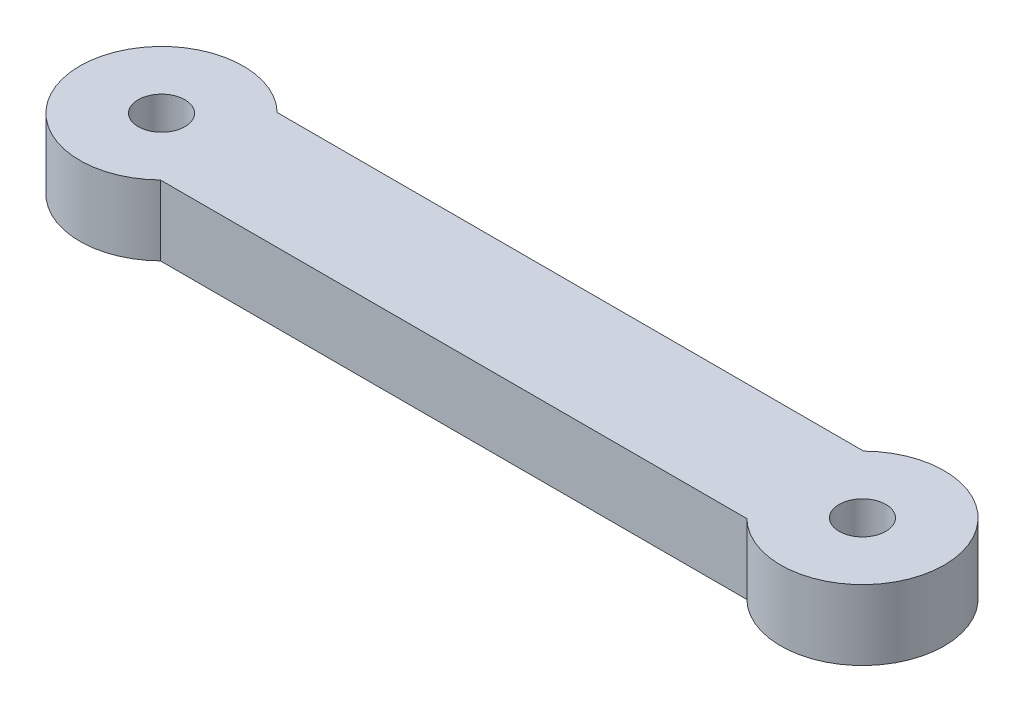
ISO-10303-21;
HEADER;
FILE_DESCRIPTION(('STEP AP214'),'2;1');
FILE_NAME('part.step','',(''),(''),'','','');
FILE_SCHEMA(('AUTOMOTIVE_DESIGN { 1 0 10303 214 1 1 1 1 }'));
ENDSEC;
DATA;
#1=APPLICATION_CONTEXT('core data for automotive mechanical design processes');
#2=APPLICATION_PROTOCOL_DEFINITION('international standard','automotive_design',2000,#1);
#3=PRODUCT_CONTEXT('',#1,'mechanical');
#4=PRODUCT('Part','Part','',(#3));
#5=PRODUCT_RELATED_PRODUCT_CATEGORY('part','',(#4));
#6=PRODUCT_DEFINITION_FORMATION('','',#4);
#7=PRODUCT_DEFINITION_CONTEXT('part definition',#1,'design');
#8=PRODUCT_DEFINITION('design','',#6,#7);
#9=PRODUCT_DEFINITION_SHAPE('','',#8);
#10=(LENGTH_UNIT() NAMED_UNIT(*) SI_UNIT(.MILLI.,.METRE.));
#11=(NAMED_UNIT(*) PLANE_ANGLE_UNIT() SI_UNIT($,.RADIAN.));
#12=(NAMED_UNIT(*) SI_UNIT($,.STERADIAN.) SOLID_ANGLE_UNIT());
#13=UNCERTAINTY_MEASURE_WITH_UNIT(LENGTH_MEASURE(1.E-05),#10,'distance_accuracy_value','');
#14=(GEOMETRIC_REPRESENTATION_CONTEXT(3) GLOBAL_UNCERTAINTY_ASSIGNED_CONTEXT((#13)) GLOBAL_UNIT_ASSIGNED_CONTEXT((#10,
#11,#12)) REPRESENTATION_CONTEXT('',''));
#15=CARTESIAN_POINT('',(0.,0.,0.));
#16=DIRECTION('',(0.,0.,1.));
#17=DIRECTION('',(1.,0.,0.));
#18=AXIS2_PLACEMENT_3D('',#15,#16,#17);
#19=CARTESIAN_POINT('',(-15.8097455641115,3.,1.20185155481779));
#20=DIRECTION('',(0.,1.,0.));
#21=DIRECTION('',(0.,0.,1.));
#22=AXIS2_PLACEMENT_3D('',#19,#20,#21);
#23=PLANE('',#22);
#24=CARTESIAN_POINT('',(-15.8097455641115,3.,1.20185155481779));
#25=DIRECTION('',(0.,1.,0.));
#26=DIRECTION('',(0.,0.,1.));
#27=AXIS2_PLACEMENT_3D('',#24,#25,#26);
#28=CIRCLE('',#27,1.);
#29=CARTESIAN_POINT('',(-15.8097455641115,3.,2.20185155481779));
#30=VERTEX_POINT('',#29);
#31=EDGE_CURVE('E100',#30,#30,#28,.T.);
#32=ORIENTED_EDGE('',*,*,#31,.F.);
#33=EDGE_LOOP('',(#32));
#34=FACE_BOUND('',#33,.T.);
#35=CARTESIAN_POINT('',(-15.8097455641115,3.,1.20185155481779));
#36=DIRECTION('',(0.,1.,0.));
#37=DIRECTION('',(0.,0.,1.));
#38=AXIS2_PLACEMENT_3D('',#35,#36,#37);
#39=CIRCLE('',#38,3.5);
#40=CARTESIAN_POINT('',(-13.3602558213283,3.,-1.29814844518222));
#41=VERTEX_POINT('',#40);
#42=CARTESIAN_POINT('',(-13.3602558213283,3.,3.70185155481778));
#43=VERTEX_POINT('',#42);
#44=EDGE_CURVE('E85',#41,#43,#39,.T.);
#45=ORIENTED_EDGE('',*,*,#44,.T.);
#46=DIRECTION('',(1.,0.,0.));
#47=VECTOR('',#46,1.);
#48=CARTESIAN_POINT('',(-13.3602558213283,3.,3.70185155481778));
#49=LINE('',#48,#47);
#50=CARTESIAN_POINT('',(11.7407646931053,3.,3.70185155481778));
#51=VERTEX_POINT('',#50);
#52=EDGE_CURVE('E80',#43,#51,#49,.T.);
#53=ORIENTED_EDGE('',*,*,#52,.T.);
#54=CARTESIAN_POINT('',(14.1902544358885,3.,1.20185155481778));
#55=DIRECTION('',(0.,1.,0.));
#56=DIRECTION('',(0.,0.,1.));
#57=AXIS2_PLACEMENT_3D('',#54,#55,#56);
#58=CIRCLE('',#57,3.5);
#59=CARTESIAN_POINT('',(11.7407646931053,3.,-1.29814844518222));
#60=VERTEX_POINT('',#59);
#61=EDGE_CURVE('E83',#51,#60,#58,.T.);
#62=ORIENTED_EDGE('',*,*,#61,.T.);
#63=DIRECTION('',(-1.,0.,0.));
#64=VECTOR('',#63,1.);
#65=CARTESIAN_POINT('',(-13.3602558213283,3.,-1.29814844518222));
#66=LINE('',#65,#64);
#67=EDGE_CURVE('E50',#60,#41,#66,.T.);
#68=ORIENTED_EDGE('',*,*,#67,.T.);
#69=EDGE_LOOP('',(#45,#53,#62,#68));
#70=FACE_BOUND('',#69,.T.);
#71=CARTESIAN_POINT('',(14.1902544358885,3.,1.20185155481778));
#72=DIRECTION('',(0.,1.,0.));
#73=DIRECTION('',(0.,0.,1.));
#74=AXIS2_PLACEMENT_3D('',#71,#72,#73);
#75=CIRCLE('',#74,1.);
#76=CARTESIAN_POINT('',(14.1902544358885,3.,2.20185155481778));
#77=VERTEX_POINT('',#76);
#78=EDGE_CURVE('E115',#77,#77,#75,.T.);
#79=ORIENTED_EDGE('',*,*,#78,.F.);
#80=EDGE_LOOP('',(#79));
#81=FACE_BOUND('',#80,.T.);
#82=ADVANCED_FACE('F33',(#34,#70,#81),#23,.T.);
#83=CARTESIAN_POINT('',(-15.8097455641115,0.,1.20185155481779));
#84=DIRECTION('',(0.,1.,0.));
#85=DIRECTION('',(0.,0.,1.));
#86=AXIS2_PLACEMENT_3D('',#83,#84,#85);
#87=PLANE('',#86);
#88=CARTESIAN_POINT('',(-15.8097455641115,0.,1.20185155481779));
#89=DIRECTION('',(0.,1.,0.));
#90=DIRECTION('',(0.,0.,1.));
#91=AXIS2_PLACEMENT_3D('',#88,#89,#90);
#92=CIRCLE('',#91,1.);
#93=CARTESIAN_POINT('',(-15.8097455641115,0.,2.20185155481779));
#94=VERTEX_POINT('',#93);
#95=EDGE_CURVE('E112',#94,#94,#92,.T.);
#96=ORIENTED_EDGE('',*,*,#95,.T.);
#97=EDGE_LOOP('',(#96));
#98=FACE_BOUND('',#97,.T.);
#99=CARTESIAN_POINT('',(-15.8097455641115,0.,1.20185155481779));
#100=DIRECTION('',(0.,1.,0.));
#101=DIRECTION('',(0.,0.,1.));
#102=AXIS2_PLACEMENT_3D('',#99,#100,#101);
#103=CIRCLE('',#102,3.5);
#104=CARTESIAN_POINT('',(-13.3602558213283,0.,-1.29814844518222));
#105=VERTEX_POINT('',#104);
#106=CARTESIAN_POINT('',(-13.3602558213283,0.,3.70185155481778));
#107=VERTEX_POINT('',#106);
#108=EDGE_CURVE('E97',#105,#107,#103,.T.);
#109=ORIENTED_EDGE('',*,*,#108,.F.);
#110=DIRECTION('',(-1.,0.,0.));
#111=VECTOR('',#110,1.);
#112=CARTESIAN_POINT('',(-13.3602558213283,0.,-1.29814844518222));
#113=LINE('',#112,#111);
#114=CARTESIAN_POINT('',(11.7407646931053,0.,-1.29814844518222));
#115=VERTEX_POINT('',#114);
#116=EDGE_CURVE('E73',#115,#105,#113,.T.);
#117=ORIENTED_EDGE('',*,*,#116,.F.);
#118=CARTESIAN_POINT('',(14.1902544358885,0.,1.20185155481778));
#119=DIRECTION('',(0.,1.,0.));
#120=DIRECTION('',(0.,0.,1.));
#121=AXIS2_PLACEMENT_3D('',#118,#119,#120);
#122=CIRCLE('',#121,3.5);
#123=CARTESIAN_POINT('',(11.7407646931053,0.,3.70185155481778));
#124=VERTEX_POINT('',#123);
#125=EDGE_CURVE('E67',#124,#115,#122,.T.);
#126=ORIENTED_EDGE('',*,*,#125,.F.);
#127=DIRECTION('',(1.,0.,0.));
#128=VECTOR('',#127,1.);
#129=CARTESIAN_POINT('',(-13.3602558213283,0.,3.70185155481778));
#130=LINE('',#129,#128);
#131=EDGE_CURVE('E89',#107,#124,#130,.T.);
#132=ORIENTED_EDGE('',*,*,#131,.F.);
#133=EDGE_LOOP('',(#109,#117,#126,#132));
#134=FACE_BOUND('',#133,.T.);
#135=CARTESIAN_POINT('',(14.1902544358885,0.,1.20185155481778));
#136=DIRECTION('',(0.,1.,0.));
#137=DIRECTION('',(0.,0.,1.));
#138=AXIS2_PLACEMENT_3D('',#135,#136,#137);
#139=CIRCLE('',#138,1.);
#140=CARTESIAN_POINT('',(14.1902544358885,0.,2.20185155481778));
#141=VERTEX_POINT('',#140);
#142=EDGE_CURVE('E118',#141,#141,#139,.T.);
#143=ORIENTED_EDGE('',*,*,#142,.T.);
#144=EDGE_LOOP('',(#143));
#145=FACE_BOUND('',#144,.T.);
#146=ADVANCED_FACE('F108',(#98,#134,#145),#87,.F.);
#147=CARTESIAN_POINT('',(-15.8097455641115,3.,1.20185155481779));
#148=DIRECTION('',(0.,-1.,0.));
#149=DIRECTION('',(0.,0.,-1.));
#150=AXIS2_PLACEMENT_3D('',#147,#148,#149);
#151=CYLINDRICAL_SURFACE('',#150,3.5);
#152=ORIENTED_EDGE('',*,*,#108,.T.);
#153=DIRECTION('',(0.,-1.,0.));
#154=VECTOR('',#153,1.);
#155=CARTESIAN_POINT('',(-13.3602558213283,3.,3.70185155481778));
#156=LINE('',#155,#154);
#157=EDGE_CURVE('E11',#43,#107,#156,.T.);
#158=ORIENTED_EDGE('',*,*,#157,.F.);
#159=ORIENTED_EDGE('',*,*,#44,.F.);
#160=DIRECTION('',(0.,-1.,0.));
#161=VECTOR('',#160,1.);
#162=CARTESIAN_POINT('',(-13.3602558213283,3.,-1.29814844518222));
#163=LINE('',#162,#161);
#164=EDGE_CURVE('E93',#41,#105,#163,.T.);
#165=ORIENTED_EDGE('',*,*,#164,.T.);
#166=EDGE_LOOP('',(#152,#158,#159,#165));
#167=FACE_BOUND('',#166,.T.);
#168=ADVANCED_FACE('F35',(#167),#151,.T.);
#169=CARTESIAN_POINT('',(-13.3602558213283,3.,3.70185155481778));
#170=DIRECTION('',(0.,0.,-1.));
#171=DIRECTION('',(-1.,0.,0.));
#172=AXIS2_PLACEMENT_3D('',#169,#170,#171);
#173=PLANE('',#172);
#174=ORIENTED_EDGE('',*,*,#131,.T.);
#175=DIRECTION('',(0.,-1.,0.));
#176=VECTOR('',#175,1.);
#177=CARTESIAN_POINT('',(11.7407646931053,3.,3.70185155481778));
#178=LINE('',#177,#176);
#179=EDGE_CURVE('E42',#51,#124,#178,.T.);
#180=ORIENTED_EDGE('',*,*,#179,.F.);
#181=ORIENTED_EDGE('',*,*,#52,.F.);
#182=ORIENTED_EDGE('',*,*,#157,.T.);
#183=EDGE_LOOP('',(#174,#180,#181,#182));
#184=FACE_BOUND('',#183,.T.);
#185=ADVANCED_FACE('F88',(#184),#173,.F.);
#186=CARTESIAN_POINT('',(14.1902544358885,3.,1.20185155481778));
#187=DIRECTION('',(0.,-1.,0.));
#188=DIRECTION('',(0.,0.,-1.));
#189=AXIS2_PLACEMENT_3D('',#186,#187,#188);
#190=CYLINDRICAL_SURFACE('',#189,3.5);
#191=ORIENTED_EDGE('',*,*,#125,.T.);
#192=DIRECTION('',(0.,-1.,0.));
#193=VECTOR('',#192,1.);
#194=CARTESIAN_POINT('',(11.7407646931053,3.,-1.29814844518222));
#195=LINE('',#194,#193);
#196=EDGE_CURVE('E90',#60,#115,#195,.T.);
#197=ORIENTED_EDGE('',*,*,#196,.F.);
#198=ORIENTED_EDGE('',*,*,#61,.F.);
#199=ORIENTED_EDGE('',*,*,#179,.T.);
#200=EDGE_LOOP('',(#191,#197,#198,#199));
#201=FACE_BOUND('',#200,.T.);
#202=ADVANCED_FACE('F91',(#201),#190,.T.);
#203=CARTESIAN_POINT('',(-13.3602558213283,3.,-1.29814844518222));
#204=DIRECTION('',(0.,0.,1.));
#205=DIRECTION('',(1.,0.,0.));
#206=AXIS2_PLACEMENT_3D('',#203,#204,#205);
#207=PLANE('',#206);
#208=ORIENTED_EDGE('',*,*,#116,.T.);
#209=ORIENTED_EDGE('',*,*,#164,.F.);
#210=ORIENTED_EDGE('',*,*,#67,.F.);
#211=ORIENTED_EDGE('',*,*,#196,.T.);
#212=EDGE_LOOP('',(#208,#209,#210,#211));
#213=FACE_BOUND('',#212,.T.);
#214=ADVANCED_FACE('F105',(#213),#207,.F.);
#215=CARTESIAN_POINT('',(-15.8097455641115,3.,1.20185155481779));
#216=DIRECTION('',(0.,-1.,0.));
#217=DIRECTION('',(0.,0.,-1.));
#218=AXIS2_PLACEMENT_3D('',#215,#216,#217);
#219=CYLINDRICAL_SURFACE('',#218,1.);
#220=ORIENTED_EDGE('',*,*,#31,.T.);
#221=EDGE_LOOP('',(#220));
#222=FACE_BOUND('',#221,.T.);
#223=ORIENTED_EDGE('',*,*,#95,.F.);
#224=EDGE_LOOP('',(#223));
#225=FACE_BOUND('',#224,.T.);
#226=ADVANCED_FACE('F136',(#222,#225),#219,.F.);
#227=CARTESIAN_POINT('',(14.1902544358885,3.,1.20185155481778));
#228=DIRECTION('',(0.,-1.,0.));
#229=DIRECTION('',(0.,0.,-1.));
#230=AXIS2_PLACEMENT_3D('',#227,#228,#229);
#231=CYLINDRICAL_SURFACE('',#230,1.);
#232=ORIENTED_EDGE('',*,*,#78,.T.);
#233=EDGE_LOOP('',(#232));
#234=FACE_BOUND('',#233,.T.);
#235=ORIENTED_EDGE('',*,*,#142,.F.);
#236=EDGE_LOOP('',(#235));
#237=FACE_BOUND('',#236,.T.);
#238=ADVANCED_FACE('F124',(#234,#237),#231,.F.);
#239=CLOSED_SHELL('',(#82,#146,#168,#185,#202,#214,#226,#238));
#240=MANIFOLD_SOLID_BREP('B2',#239);
#241=ADVANCED_BREP_SHAPE_REPRESENTATION('',(#18,#240),#14);
#242=SHAPE_DEFINITION_REPRESENTATION(#9,#241);
ENDSEC;
END-ISO-10303-21;
